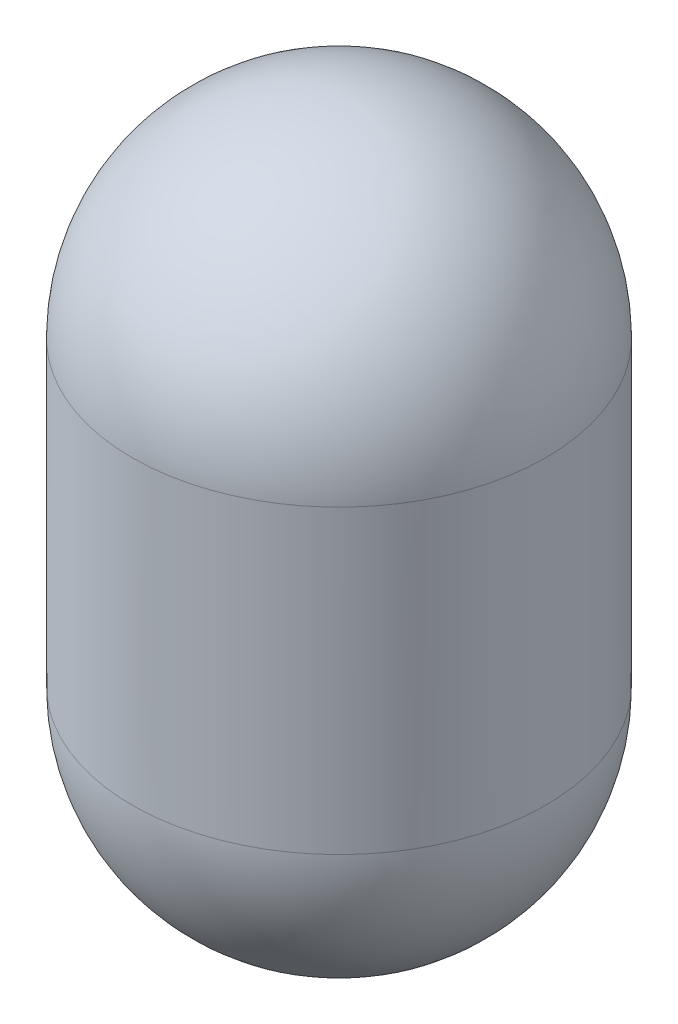
ISO-10303-21;
HEADER;
FILE_DESCRIPTION(('STEP AP214'),'2;1');
FILE_NAME('part.step','',(''),(''),'','','');
FILE_SCHEMA(('AUTOMOTIVE_DESIGN { 1 0 10303 214 1 1 1 1 }'));
ENDSEC;
DATA;
#1=APPLICATION_CONTEXT('core data for automotive mechanical design processes');
#2=APPLICATION_PROTOCOL_DEFINITION('international standard','automotive_design',2000,#1);
#3=PRODUCT_CONTEXT('',#1,'mechanical');
#4=PRODUCT('Part','Part','',(#3));
#5=PRODUCT_RELATED_PRODUCT_CATEGORY('part','',(#4));
#6=PRODUCT_DEFINITION_FORMATION('','',#4);
#7=PRODUCT_DEFINITION_CONTEXT('part definition',#1,'design');
#8=PRODUCT_DEFINITION('design','',#6,#7);
#9=PRODUCT_DEFINITION_SHAPE('','',#8);
#10=(LENGTH_UNIT() NAMED_UNIT(*) SI_UNIT(.MILLI.,.METRE.));
#11=(NAMED_UNIT(*) PLANE_ANGLE_UNIT() SI_UNIT($,.RADIAN.));
#12=(NAMED_UNIT(*) SI_UNIT($,.STERADIAN.) SOLID_ANGLE_UNIT());
#13=UNCERTAINTY_MEASURE_WITH_UNIT(LENGTH_MEASURE(1.E-05),#10,'distance_accuracy_value','');
#14=(GEOMETRIC_REPRESENTATION_CONTEXT(3) GLOBAL_UNCERTAINTY_ASSIGNED_CONTEXT((#13)) GLOBAL_UNIT_ASSIGNED_CONTEXT((#10,
#11,#12)) REPRESENTATION_CONTEXT('',''));
#15=CARTESIAN_POINT('',(0.,0.,0.));
#16=DIRECTION('',(0.,0.,1.));
#17=DIRECTION('',(1.,0.,0.));
#18=AXIS2_PLACEMENT_3D('',#15,#16,#17);
#19=CARTESIAN_POINT('',(0.,101.6,0.));
#20=DIRECTION('',(0.,-1.,0.));
#21=DIRECTION('',(0.,0.,-1.));
#22=AXIS2_PLACEMENT_3D('',#19,#20,#21);
#23=CYLINDRICAL_SURFACE('',#22,69.85);
#24=CARTESIAN_POINT('',(0.,101.6,0.));
#25=DIRECTION('',(0.,1.,0.));
#26=DIRECTION('',(0.,0.,1.));
#27=AXIS2_PLACEMENT_3D('',#24,#25,#26);
#28=CIRCLE('',#27,69.85);
#29=CARTESIAN_POINT('',(0.,101.6,69.85));
#30=VERTEX_POINT('',#29);
#31=EDGE_CURVE('E10',#30,#30,#28,.T.);
#32=ORIENTED_EDGE('',*,*,#31,.F.);
#33=EDGE_LOOP('',(#32));
#34=FACE_BOUND('',#33,.T.);
#35=CARTESIAN_POINT('',(0.,0.,0.));
#36=DIRECTION('',(0.,-1.,0.));
#37=DIRECTION('',(0.,0.,-1.));
#38=AXIS2_PLACEMENT_3D('',#35,#36,#37);
#39=CIRCLE('',#38,69.85);
#40=CARTESIAN_POINT('',(0.,0.,-69.85));
#41=VERTEX_POINT('',#40);
#42=EDGE_CURVE('E40',#41,#41,#39,.T.);
#43=ORIENTED_EDGE('',*,*,#42,.F.);
#44=EDGE_LOOP('',(#43));
#45=FACE_BOUND('',#44,.T.);
#46=ADVANCED_FACE('F34',(#34,#45),#23,.T.);
#47=CARTESIAN_POINT('',(0.,101.6,0.));
#48=DIRECTION('',(0.,1.,0.));
#49=DIRECTION('',(1.,0.,0.));
#50=AXIS2_PLACEMENT_3D('',#47,#48,#49);
#51=SPHERICAL_SURFACE('',#50,69.85);
#52=ORIENTED_EDGE('',*,*,#31,.T.);
#53=EDGE_LOOP('',(#52));
#54=FACE_BOUND('',#53,.T.);
#55=ADVANCED_FACE('F49',(#54),#51,.T.);
#56=CARTESIAN_POINT('',(0.,0.,0.));
#57=DIRECTION('',(0.,-1.,0.));
#58=DIRECTION('',(-1.,0.,0.));
#59=AXIS2_PLACEMENT_3D('',#56,#57,#58);
#60=SPHERICAL_SURFACE('',#59,69.85);
#61=ORIENTED_EDGE('',*,*,#42,.T.);
#62=EDGE_LOOP('',(#61));
#63=FACE_BOUND('',#62,.T.);
#64=ADVANCED_FACE('F46',(#63),#60,.T.);
#65=CLOSED_SHELL('',(#46,#55,#64));
#66=MANIFOLD_SOLID_BREP('B2',#65);
#67=ADVANCED_BREP_SHAPE_REPRESENTATION('',(#18,#66),#14);
#68=SHAPE_DEFINITION_REPRESENTATION(#9,#67);
ENDSEC;
END-ISO-10303-21;
